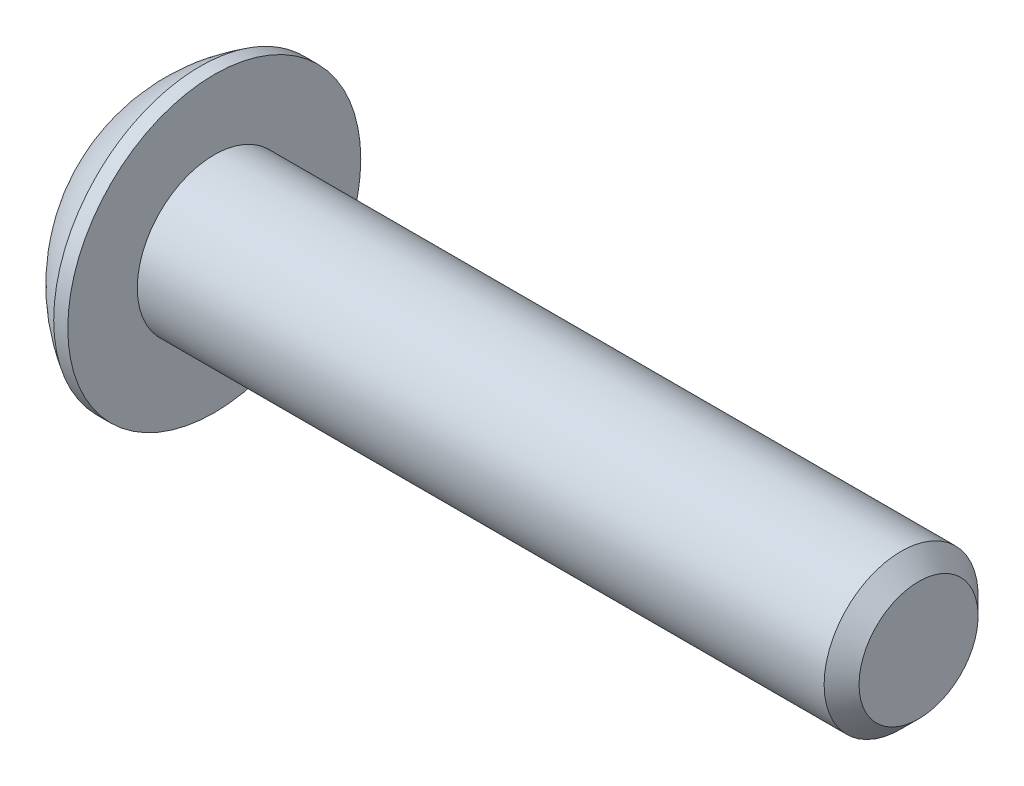
ISO-10303-21;
HEADER;
FILE_DESCRIPTION(('STEP AP214'),'2;1');
FILE_NAME('part.step','',(''),(''),'','','');
FILE_SCHEMA(('AUTOMOTIVE_DESIGN { 1 0 10303 214 1 1 1 1 }'));
ENDSEC;
DATA;
#1=APPLICATION_CONTEXT('core data for automotive mechanical design processes');
#2=APPLICATION_PROTOCOL_DEFINITION('international standard','automotive_design',2000,#1);
#3=PRODUCT_CONTEXT('',#1,'mechanical');
#4=PRODUCT('Part','Part','',(#3));
#5=PRODUCT_RELATED_PRODUCT_CATEGORY('part','',(#4));
#6=PRODUCT_DEFINITION_FORMATION('','',#4);
#7=PRODUCT_DEFINITION_CONTEXT('part definition',#1,'design');
#8=PRODUCT_DEFINITION('design','',#6,#7);
#9=PRODUCT_DEFINITION_SHAPE('','',#8);
#10=(LENGTH_UNIT() NAMED_UNIT(*) SI_UNIT(.MILLI.,.METRE.));
#11=(NAMED_UNIT(*) PLANE_ANGLE_UNIT() SI_UNIT($,.RADIAN.));
#12=(NAMED_UNIT(*) SI_UNIT($,.STERADIAN.) SOLID_ANGLE_UNIT());
#13=UNCERTAINTY_MEASURE_WITH_UNIT(LENGTH_MEASURE(1.E-05),#10,'distance_accuracy_value','');
#14=(GEOMETRIC_REPRESENTATION_CONTEXT(3) GLOBAL_UNCERTAINTY_ASSIGNED_CONTEXT((#13)) GLOBAL_UNIT_ASSIGNED_CONTEXT((#10,
#11,#12)) REPRESENTATION_CONTEXT('',''));
#15=CARTESIAN_POINT('',(0.,0.,0.));
#16=DIRECTION('',(0.,0.,1.));
#17=DIRECTION('',(1.,0.,0.));
#18=AXIS2_PLACEMENT_3D('',#15,#16,#17);
#19=CARTESIAN_POINT('',(1.32080000000034,0.,0.));
#20=DIRECTION('',(-1.,0.,0.));
#21=DIRECTION('',(0.,0.,1.));
#22=AXIS2_PLACEMENT_3D('',#19,#20,#21);
#23=CONICAL_SURFACE('',#22,1.1937999999998,1.04719755119608);
#24=CARTESIAN_POINT('',(2.01004075135902,0.,4.44089209850063E-13));
#25=VERTEX_POINT('',#24);
#26=VERTEX_LOOP('',#25);
#27=FACE_BOUND('',#26,.T.);
#28=CARTESIAN_POINT('',(1.32080000000009,0.,0.));
#29=DIRECTION('',(-1.,0.,0.));
#30=DIRECTION('',(0.,0.,1.));
#31=AXIS2_PLACEMENT_3D('',#28,#29,#30);
#32=CIRCLE('',#31,1.19380000000024);
#33=CARTESIAN_POINT('',(1.32080000000004,-1.03386112703797,0.59690000000006));
#34=VERTEX_POINT('',#33);
#35=CARTESIAN_POINT('',(1.32080000000004,0.,1.19380000000012));
#36=VERTEX_POINT('',#35);
#37=EDGE_CURVE('E18',#34,#36,#32,.T.);
#38=ORIENTED_EDGE('',*,*,#37,.T.);
#39=CARTESIAN_POINT('',(1.32080000000009,0.,0.));
#40=DIRECTION('',(-1.,0.,0.));
#41=DIRECTION('',(0.,0.,1.));
#42=AXIS2_PLACEMENT_3D('',#39,#40,#41);
#43=CIRCLE('',#42,1.19380000000024);
#44=CARTESIAN_POINT('',(1.32080000000004,1.03386112703797,0.596900000000061));
#45=VERTEX_POINT('',#44);
#46=EDGE_CURVE('E139',#36,#45,#43,.T.);
#47=ORIENTED_EDGE('',*,*,#46,.T.);
#48=CARTESIAN_POINT('',(1.32080000000009,0.,0.));
#49=DIRECTION('',(-1.,0.,0.));
#50=DIRECTION('',(0.,0.,1.));
#51=AXIS2_PLACEMENT_3D('',#48,#49,#50);
#52=CIRCLE('',#51,1.19380000000024);
#53=CARTESIAN_POINT('',(1.32080000000004,1.03386112703797,-0.596900000000061));
#54=VERTEX_POINT('',#53);
#55=EDGE_CURVE('E268',#45,#54,#52,.T.);
#56=ORIENTED_EDGE('',*,*,#55,.T.);
#57=CARTESIAN_POINT('',(1.32080000000009,0.,0.));
#58=DIRECTION('',(-1.,0.,0.));
#59=DIRECTION('',(0.,0.,1.));
#60=AXIS2_PLACEMENT_3D('',#57,#58,#59);
#61=CIRCLE('',#60,1.19380000000024);
#62=CARTESIAN_POINT('',(1.32080000000004,1.49457637585666E-12,-1.19380000000012));
#63=VERTEX_POINT('',#62);
#64=EDGE_CURVE('E266',#54,#63,#61,.T.);
#65=ORIENTED_EDGE('',*,*,#64,.T.);
#66=CARTESIAN_POINT('',(1.32080000000009,0.,0.));
#67=DIRECTION('',(-1.,0.,0.));
#68=DIRECTION('',(0.,0.,1.));
#69=AXIS2_PLACEMENT_3D('',#66,#67,#68);
#70=CIRCLE('',#69,1.19380000000024);
#71=CARTESIAN_POINT('',(1.32080000000004,-1.03386112703797,-0.59690000000006));
#72=VERTEX_POINT('',#71);
#73=EDGE_CURVE('E91',#63,#72,#70,.T.);
#74=ORIENTED_EDGE('',*,*,#73,.T.);
#75=CARTESIAN_POINT('',(1.32080000000009,0.,0.));
#76=DIRECTION('',(-1.,0.,0.));
#77=DIRECTION('',(0.,0.,1.));
#78=AXIS2_PLACEMENT_3D('',#75,#76,#77);
#79=CIRCLE('',#78,1.19380000000024);
#80=EDGE_CURVE('E87',#72,#34,#79,.T.);
#81=ORIENTED_EDGE('',*,*,#80,.T.);
#82=EDGE_LOOP('',(#38,#47,#56,#65,#74,#81));
#83=FACE_BOUND('',#82,.T.);
#84=ADVANCED_FACE('F14',(#27,#83),#23,.F.);
#85=CARTESIAN_POINT('',(1.3208,-2.06772225407572,-1.1938));
#86=DIRECTION('',(1.,0.,0.));
#87=DIRECTION('',(0.,0.,-1.));
#88=AXIS2_PLACEMENT_3D('',#85,#86,#87);
#89=PLANE('',#88);
#90=DIRECTION('',(0.,0.5,0.866025403784439));
#91=VECTOR('',#90,1.);
#92=CARTESIAN_POINT('',(1.3208,-1.37848150271715,0.));
#93=LINE('',#92,#91);
#94=CARTESIAN_POINT('',(1.3208,-0.689240751358574,1.1938));
#95=VERTEX_POINT('',#94);
#96=EDGE_CURVE('E99',#95,#34,#93,.F.);
#97=ORIENTED_EDGE('',*,*,#96,.F.);
#98=DIRECTION('',(0.,1.,0.));
#99=VECTOR('',#98,1.);
#100=CARTESIAN_POINT('',(1.3208,-0.689240751358574,1.1938));
#101=LINE('',#100,#99);
#102=EDGE_CURVE('E101',#36,#95,#101,.F.);
#103=ORIENTED_EDGE('',*,*,#102,.F.);
#104=ORIENTED_EDGE('',*,*,#37,.F.);
#105=EDGE_LOOP('',(#97,#103,#104));
#106=FACE_BOUND('',#105,.T.);
#107=ADVANCED_FACE('F97',(#106),#89,.F.);
#108=CARTESIAN_POINT('',(1.3208,-2.06772225407572,-1.1938));
#109=DIRECTION('',(1.,0.,0.));
#110=DIRECTION('',(0.,0.,-1.));
#111=AXIS2_PLACEMENT_3D('',#108,#109,#110);
#112=PLANE('',#111);
#113=DIRECTION('',(0.,-0.5,0.866025403784439));
#114=VECTOR('',#113,1.);
#115=CARTESIAN_POINT('',(1.3208,-0.689240751358574,-1.1938));
#116=LINE('',#115,#114);
#117=CARTESIAN_POINT('',(1.3208,-1.37848150271715,0.));
#118=VERTEX_POINT('',#117);
#119=EDGE_CURVE('E107',#118,#72,#116,.F.);
#120=ORIENTED_EDGE('',*,*,#119,.F.);
#121=DIRECTION('',(0.,0.5,0.866025403784439));
#122=VECTOR('',#121,1.);
#123=CARTESIAN_POINT('',(1.3208,-1.37848150271715,0.));
#124=LINE('',#123,#122);
#125=EDGE_CURVE('E104',#34,#118,#124,.F.);
#126=ORIENTED_EDGE('',*,*,#125,.F.);
#127=ORIENTED_EDGE('',*,*,#80,.F.);
#128=EDGE_LOOP('',(#120,#126,#127));
#129=FACE_BOUND('',#128,.T.);
#130=ADVANCED_FACE('F105',(#129),#112,.F.);
#131=CARTESIAN_POINT('',(1.3208,-2.06772225407572,-1.1938));
#132=DIRECTION('',(1.,0.,0.));
#133=DIRECTION('',(0.,0.,-1.));
#134=AXIS2_PLACEMENT_3D('',#131,#132,#133);
#135=PLANE('',#134);
#136=DIRECTION('',(0.,1.,0.));
#137=VECTOR('',#136,1.);
#138=CARTESIAN_POINT('',(1.3208,0.689240751358577,-1.1938));
#139=LINE('',#138,#137);
#140=CARTESIAN_POINT('',(1.3208,-0.689240751358574,-1.1938));
#141=VERTEX_POINT('',#140);
#142=EDGE_CURVE('E235',#141,#63,#139,.T.);
#143=ORIENTED_EDGE('',*,*,#142,.F.);
#144=DIRECTION('',(0.,-0.5,0.866025403784439));
#145=VECTOR('',#144,1.);
#146=CARTESIAN_POINT('',(1.3208,-0.689240751358574,-1.1938));
#147=LINE('',#146,#145);
#148=EDGE_CURVE('E240',#72,#141,#147,.F.);
#149=ORIENTED_EDGE('',*,*,#148,.F.);
#150=ORIENTED_EDGE('',*,*,#73,.F.);
#151=EDGE_LOOP('',(#143,#149,#150));
#152=FACE_BOUND('',#151,.T.);
#153=ADVANCED_FACE('F182',(#152),#135,.F.);
#154=CARTESIAN_POINT('',(1.3208,-2.06772225407572,-1.1938));
#155=DIRECTION('',(1.,0.,0.));
#156=DIRECTION('',(0.,0.,-1.));
#157=AXIS2_PLACEMENT_3D('',#154,#155,#156);
#158=PLANE('',#157);
#159=DIRECTION('',(0.,-0.5,-0.866025403784439));
#160=VECTOR('',#159,1.);
#161=CARTESIAN_POINT('',(1.3208,1.37848150271715,0.));
#162=LINE('',#161,#160);
#163=CARTESIAN_POINT('',(1.3208,0.689240751358577,-1.1938));
#164=VERTEX_POINT('',#163);
#165=EDGE_CURVE('E226',#164,#54,#162,.F.);
#166=ORIENTED_EDGE('',*,*,#165,.F.);
#167=DIRECTION('',(0.,1.,0.));
#168=VECTOR('',#167,1.);
#169=CARTESIAN_POINT('',(1.3208,0.689240751358577,-1.1938));
#170=LINE('',#169,#168);
#171=EDGE_CURVE('E232',#63,#164,#170,.T.);
#172=ORIENTED_EDGE('',*,*,#171,.F.);
#173=ORIENTED_EDGE('',*,*,#64,.F.);
#174=EDGE_LOOP('',(#166,#172,#173));
#175=FACE_BOUND('',#174,.T.);
#176=ADVANCED_FACE('F178',(#175),#158,.F.);
#177=CARTESIAN_POINT('',(1.3208,-2.06772225407572,-1.1938));
#178=DIRECTION('',(1.,0.,0.));
#179=DIRECTION('',(0.,0.,-1.));
#180=AXIS2_PLACEMENT_3D('',#177,#178,#179);
#181=PLANE('',#180);
#182=DIRECTION('',(0.,0.5,-0.866025403784439));
#183=VECTOR('',#182,1.);
#184=CARTESIAN_POINT('',(1.3208,0.689240751358576,1.1938));
#185=LINE('',#184,#183);
#186=CARTESIAN_POINT('',(1.3208,1.37848150271715,0.));
#187=VERTEX_POINT('',#186);
#188=EDGE_CURVE('E213',#187,#45,#185,.F.);
#189=ORIENTED_EDGE('',*,*,#188,.F.);
#190=DIRECTION('',(0.,-0.5,-0.866025403784439));
#191=VECTOR('',#190,1.);
#192=CARTESIAN_POINT('',(1.3208,1.37848150271715,0.));
#193=LINE('',#192,#191);
#194=EDGE_CURVE('E224',#54,#187,#193,.F.);
#195=ORIENTED_EDGE('',*,*,#194,.F.);
#196=ORIENTED_EDGE('',*,*,#55,.F.);
#197=EDGE_LOOP('',(#189,#195,#196));
#198=FACE_BOUND('',#197,.T.);
#199=ADVANCED_FACE('F174',(#198),#181,.F.);
#200=CARTESIAN_POINT('',(1.3208,-2.06772225407572,-1.1938));
#201=DIRECTION('',(1.,0.,0.));
#202=DIRECTION('',(0.,0.,-1.));
#203=AXIS2_PLACEMENT_3D('',#200,#201,#202);
#204=PLANE('',#203);
#205=DIRECTION('',(0.,1.,0.));
#206=VECTOR('',#205,1.);
#207=CARTESIAN_POINT('',(1.3208,-0.689240751358574,1.1938));
#208=LINE('',#207,#206);
#209=CARTESIAN_POINT('',(1.3208,0.689240751358576,1.1938));
#210=VERTEX_POINT('',#209);
#211=EDGE_CURVE('E116',#210,#36,#208,.F.);
#212=ORIENTED_EDGE('',*,*,#211,.F.);
#213=DIRECTION('',(0.,0.5,-0.866025403784439));
#214=VECTOR('',#213,1.);
#215=CARTESIAN_POINT('',(1.3208,0.689240751358576,1.1938));
#216=LINE('',#215,#214);
#217=EDGE_CURVE('E216',#45,#210,#216,.F.);
#218=ORIENTED_EDGE('',*,*,#217,.F.);
#219=ORIENTED_EDGE('',*,*,#46,.F.);
#220=EDGE_LOOP('',(#212,#218,#219));
#221=FACE_BOUND('',#220,.T.);
#222=ADVANCED_FACE('F170',(#221),#204,.F.);
#223=CARTESIAN_POINT('',(1.3208,-0.689240751358574,1.1938));
#224=DIRECTION('',(0.,0.,-1.));
#225=DIRECTION('',(0.,1.,0.));
#226=AXIS2_PLACEMENT_3D('',#223,#224,#225);
#227=PLANE('',#226);
#228=DIRECTION('',(0.,1.,0.));
#229=VECTOR('',#228,1.);
#230=CARTESIAN_POINT('',(0.,0.,1.1938));
#231=LINE('',#230,#229);
#232=CARTESIAN_POINT('',(0.,0.689240751358577,1.1938));
#233=VERTEX_POINT('',#232);
#234=CARTESIAN_POINT('',(0.,-0.689240751358574,1.1938));
#235=VERTEX_POINT('',#234);
#236=EDGE_CURVE('E228',#233,#235,#231,.F.);
#237=ORIENTED_EDGE('',*,*,#236,.F.);
#238=DIRECTION('',(1.,0.,0.));
#239=VECTOR('',#238,1.);
#240=CARTESIAN_POINT('',(1.3208,0.689240751358576,1.1938));
#241=LINE('',#240,#239);
#242=EDGE_CURVE('E220',#210,#233,#241,.F.);
#243=ORIENTED_EDGE('',*,*,#242,.F.);
#244=ORIENTED_EDGE('',*,*,#211,.T.);
#245=ORIENTED_EDGE('',*,*,#102,.T.);
#246=DIRECTION('',(1.,0.,0.));
#247=VECTOR('',#246,1.);
#248=CARTESIAN_POINT('',(1.3208,-0.689240751358574,1.1938));
#249=LINE('',#248,#247);
#250=EDGE_CURVE('E110',#235,#95,#249,.T.);
#251=ORIENTED_EDGE('',*,*,#250,.F.);
#252=EDGE_LOOP('',(#237,#243,#244,#245,#251));
#253=FACE_BOUND('',#252,.T.);
#254=ADVANCED_FACE('F167',(#253),#227,.T.);
#255=CARTESIAN_POINT('',(1.3208,-1.37848150271715,0.));
#256=DIRECTION('',(0.,0.866025403784439,-0.5));
#257=DIRECTION('',(0.,0.5,0.866025403784439));
#258=AXIS2_PLACEMENT_3D('',#255,#256,#257);
#259=PLANE('',#258);
#260=DIRECTION('',(0.,-0.5,-0.866025403784439));
#261=VECTOR('',#260,1.);
#262=CARTESIAN_POINT('',(0.,-0.689240751358574,1.1938));
#263=LINE('',#262,#261);
#264=CARTESIAN_POINT('',(0.,-1.37848150271715,0.));
#265=VERTEX_POINT('',#264);
#266=EDGE_CURVE('E249',#235,#265,#263,.T.);
#267=ORIENTED_EDGE('',*,*,#266,.F.);
#268=ORIENTED_EDGE('',*,*,#250,.T.);
#269=ORIENTED_EDGE('',*,*,#96,.T.);
#270=ORIENTED_EDGE('',*,*,#125,.T.);
#271=DIRECTION('',(1.,0.,0.));
#272=VECTOR('',#271,1.);
#273=CARTESIAN_POINT('',(1.3208,-1.37848150271715,0.));
#274=LINE('',#273,#272);
#275=EDGE_CURVE('E119',#265,#118,#274,.T.);
#276=ORIENTED_EDGE('',*,*,#275,.F.);
#277=EDGE_LOOP('',(#267,#268,#269,#270,#276));
#278=FACE_BOUND('',#277,.T.);
#279=ADVANCED_FACE('F114',(#278),#259,.T.);
#280=CARTESIAN_POINT('',(1.3208,-0.689240751358574,-1.1938));
#281=DIRECTION('',(0.,0.866025403784439,0.5));
#282=DIRECTION('',(0.,-0.5,0.866025403784439));
#283=AXIS2_PLACEMENT_3D('',#280,#281,#282);
#284=PLANE('',#283);
#285=DIRECTION('',(0.,0.5,-0.866025403784439));
#286=VECTOR('',#285,1.);
#287=CARTESIAN_POINT('',(0.,-1.37848150271715,0.));
#288=LINE('',#287,#286);
#289=CARTESIAN_POINT('',(0.,-0.689240751358574,-1.1938));
#290=VERTEX_POINT('',#289);
#291=EDGE_CURVE('E247',#265,#290,#288,.T.);
#292=ORIENTED_EDGE('',*,*,#291,.F.);
#293=ORIENTED_EDGE('',*,*,#275,.T.);
#294=ORIENTED_EDGE('',*,*,#119,.T.);
#295=ORIENTED_EDGE('',*,*,#148,.T.);
#296=DIRECTION('',(1.,0.,0.));
#297=VECTOR('',#296,1.);
#298=CARTESIAN_POINT('',(1.3208,-0.689240751358574,-1.1938));
#299=LINE('',#298,#297);
#300=EDGE_CURVE('E231',#290,#141,#299,.T.);
#301=ORIENTED_EDGE('',*,*,#300,.F.);
#302=EDGE_LOOP('',(#292,#293,#294,#295,#301));
#303=FACE_BOUND('',#302,.T.);
#304=ADVANCED_FACE('F160',(#303),#284,.T.);
#305=CARTESIAN_POINT('',(1.3208,0.689240751358577,-1.1938));
#306=DIRECTION('',(0.,0.,1.));
#307=DIRECTION('',(1.,0.,0.));
#308=AXIS2_PLACEMENT_3D('',#305,#306,#307);
#309=PLANE('',#308);
#310=DIRECTION('',(0.,1.,0.));
#311=VECTOR('',#310,1.);
#312=CARTESIAN_POINT('',(0.,0.,-1.1938));
#313=LINE('',#312,#311);
#314=CARTESIAN_POINT('',(0.,0.689240751358577,-1.1938));
#315=VERTEX_POINT('',#314);
#316=EDGE_CURVE('E258',#290,#315,#313,.T.);
#317=ORIENTED_EDGE('',*,*,#316,.F.);
#318=ORIENTED_EDGE('',*,*,#300,.T.);
#319=ORIENTED_EDGE('',*,*,#142,.T.);
#320=ORIENTED_EDGE('',*,*,#171,.T.);
#321=DIRECTION('',(1.,0.,0.));
#322=VECTOR('',#321,1.);
#323=CARTESIAN_POINT('',(1.3208,0.689240751358577,-1.1938));
#324=LINE('',#323,#322);
#325=EDGE_CURVE('E217',#315,#164,#324,.T.);
#326=ORIENTED_EDGE('',*,*,#325,.F.);
#327=EDGE_LOOP('',(#317,#318,#319,#320,#326));
#328=FACE_BOUND('',#327,.T.);
#329=ADVANCED_FACE('F157',(#328),#309,.T.);
#330=CARTESIAN_POINT('',(1.3208,1.37848150271715,0.));
#331=DIRECTION('',(0.,-0.866025403784439,0.5));
#332=DIRECTION('',(0.,-0.5,-0.866025403784439));
#333=AXIS2_PLACEMENT_3D('',#330,#331,#332);
#334=PLANE('',#333);
#335=DIRECTION('',(0.,0.5,0.866025403784439));
#336=VECTOR('',#335,1.);
#337=CARTESIAN_POINT('',(0.,0.689240751358577,-1.1938));
#338=LINE('',#337,#336);
#339=CARTESIAN_POINT('',(0.,1.37848150271715,0.));
#340=VERTEX_POINT('',#339);
#341=EDGE_CURVE('E261',#315,#340,#338,.T.);
#342=ORIENTED_EDGE('',*,*,#341,.F.);
#343=ORIENTED_EDGE('',*,*,#325,.T.);
#344=ORIENTED_EDGE('',*,*,#165,.T.);
#345=ORIENTED_EDGE('',*,*,#194,.T.);
#346=DIRECTION('',(1.,0.,0.));
#347=VECTOR('',#346,1.);
#348=CARTESIAN_POINT('',(1.3208,1.37848150271715,0.));
#349=LINE('',#348,#347);
#350=EDGE_CURVE('E33',#340,#187,#349,.T.);
#351=ORIENTED_EDGE('',*,*,#350,.F.);
#352=EDGE_LOOP('',(#342,#343,#344,#345,#351));
#353=FACE_BOUND('',#352,.T.);
#354=ADVANCED_FACE('F153',(#353),#334,.T.);
#355=CARTESIAN_POINT('',(1.3208,0.689240751358576,1.1938));
#356=DIRECTION('',(0.,-0.866025403784439,-0.5));
#357=DIRECTION('',(0.,0.5,-0.866025403784439));
#358=AXIS2_PLACEMENT_3D('',#355,#356,#357);
#359=PLANE('',#358);
#360=DIRECTION('',(0.,-0.5,0.866025403784439));
#361=VECTOR('',#360,1.);
#362=CARTESIAN_POINT('',(0.,1.37848150271715,0.));
#363=LINE('',#362,#361);
#364=EDGE_CURVE('E138',#340,#233,#363,.T.);
#365=ORIENTED_EDGE('',*,*,#364,.F.);
#366=ORIENTED_EDGE('',*,*,#350,.T.);
#367=ORIENTED_EDGE('',*,*,#188,.T.);
#368=ORIENTED_EDGE('',*,*,#217,.T.);
#369=ORIENTED_EDGE('',*,*,#242,.T.);
#370=EDGE_LOOP('',(#365,#366,#367,#368,#369));
#371=FACE_BOUND('',#370,.T.);
#372=ADVANCED_FACE('F149',(#371),#359,.T.);
#373=CARTESIAN_POINT('',(0.,0.,0.));
#374=DIRECTION('',(-1.,0.,0.));
#375=DIRECTION('',(0.,0.,1.));
#376=AXIS2_PLACEMENT_3D('',#373,#374,#375);
#377=PLANE('',#376);
#378=ORIENTED_EDGE('',*,*,#341,.T.);
#379=ORIENTED_EDGE('',*,*,#364,.T.);
#380=ORIENTED_EDGE('',*,*,#236,.T.);
#381=ORIENTED_EDGE('',*,*,#266,.T.);
#382=ORIENTED_EDGE('',*,*,#291,.T.);
#383=ORIENTED_EDGE('',*,*,#316,.T.);
#384=EDGE_LOOP('',(#378,#379,#380,#381,#382,#383));
#385=FACE_BOUND('',#384,.T.);
#386=CARTESIAN_POINT('',(0.,1.9812,0.));
#387=CARTESIAN_POINT('',(0.,1.9811996664299,0.0556258831179429));
#388=CARTESIAN_POINT('',(0.,1.97885520380442,0.111261989398606));
#389=CARTESIAN_POINT('',(0.,1.96949260169541,0.222149719830458));
#390=CARTESIAN_POINT('',(0.,1.96247308239606,0.277401225602896));
#391=CARTESIAN_POINT('',(0.,1.94379192841039,0.387209508139748));
#392=CARTESIAN_POINT('',(-1.85322098412163E-13,1.93212292489526,0.441765039546366));
#393=CARTESIAN_POINT('',(1.86340516395781E-13,1.90422331175315,0.549729449347493));
#394=CARTESIAN_POINT('',(6.9454338814387E-13,1.88798900035338,0.603137359208869));
#395=CARTESIAN_POINT('',(1.15501971975443E-12,1.832662144765,0.760839131321828));
#396=CARTESIAN_POINT('',(0.,1.78690023648845,0.86287643357543));
#397=CARTESIAN_POINT('',(0.,1.67887358150667,1.05780719540872));
#398=CARTESIAN_POINT('',(9.54252846156157E-13,1.6166082074585,1.15070030720801));
#399=CARTESIAN_POINT('',(5.94775737193293E-13,1.51224157140982,1.28116890915698));
#400=CARTESIAN_POINT('',(1.63135429314554E-13,1.47559703943539,1.32320451127027));
#401=CARTESIAN_POINT('',(-1.62111198585679E-13,1.39893832619713,1.40400288695709));
#402=CARTESIAN_POINT('',(0.,1.35892742784698,1.44276877695455));
#403=CARTESIAN_POINT('',(1.13736409396491E-13,1.23416504602197,1.55382272417904));
#404=CARTESIAN_POINT('',(0.,1.14466125559859,1.62089527952111));
#405=CARTESIAN_POINT('',(0.,0.955712144178161,1.73902218081179));
#406=CARTESIAN_POINT('',(0.,0.856267198233561,1.79007713076008));
#407=CARTESIAN_POINT('',(0.,0.65020634591084,1.87477637530954));
#408=CARTESIAN_POINT('',(0.,0.543590516134851,1.90842085586266));
#409=CARTESIAN_POINT('',(0.,0.326226155292014,1.95733039300656));
#410=CARTESIAN_POINT('',(0.,0.215477602157926,1.97259535144288));
#411=CARTESIAN_POINT('',(0.,-0.00701040587545002,1.98431697865418));
#412=CARTESIAN_POINT('',(0.,-0.118749860774737,1.98077364742916));
#413=CARTESIAN_POINT('',(0.,-0.340050178355489,1.95497485623824));
#414=CARTESIAN_POINT('',(0.,-0.449611052668259,1.93271949620217));
#415=CARTESIAN_POINT('',(0.,-0.663431110729177,1.87014138774524));
#416=CARTESIAN_POINT('',(0.,-0.767690237838523,1.82981844635272));
#417=CARTESIAN_POINT('',(0.,-0.968005760719348,1.73219968377096));
#418=CARTESIAN_POINT('',(0.,-1.0640618469811,1.6749032225164));
#419=CARTESIAN_POINT('',(0.,-1.19980276751283,1.57757371205873));
#420=CARTESIAN_POINT('',(0.,-1.24366557129214,1.54322665019466));
#421=CARTESIAN_POINT('',(0.,-1.32838995706696,1.47093063174264));
#422=CARTESIAN_POINT('',(0.,-1.36924860178706,1.43297823102439));
#423=CARTESIAN_POINT('',(0.,-1.48674671849223,1.31419842051172));
#424=CARTESIAN_POINT('',(0.,-1.55842832343237,1.22836221289311));
#425=CARTESIAN_POINT('',(0.,-1.6863396856475,1.04586168272493));
#426=CARTESIAN_POINT('',(0.,-1.7425700302488,0.949197771949769));
#427=CARTESIAN_POINT('',(0.,-1.8141614250401,0.798182600298679));
#428=CARTESIAN_POINT('',(0.,-1.83591780585875,0.746776203847787));
#429=CARTESIAN_POINT('',(0.,-1.87500754181092,0.642341081688632));
#430=CARTESIAN_POINT('',(0.,-1.89234447645404,0.589313708122843));
#431=CARTESIAN_POINT('',(0.,-1.92246053433555,0.482076273028391));
#432=CARTESIAN_POINT('',(0.,-1.93524685475118,0.427868224257506));
#433=CARTESIAN_POINT('',(0.,-1.95620937250494,0.318578151844607));
#434=CARTESIAN_POINT('',(0.,-1.96438692958147,0.263496390912868));
#435=CARTESIAN_POINT('',(0.,-1.97388528284653,0.173607715038555));
#436=CARTESIAN_POINT('',(0.,-1.97662743364426,0.138944718024995));
#437=CARTESIAN_POINT('',(0.,-1.98028489645283,0.069522478256699));
#438=CARTESIAN_POINT('',(0.,-1.98120020846367,0.0347632355019625));
#439=CARTESIAN_POINT('',(0.,-1.9811996664299,-0.0556258831179437));
#440=CARTESIAN_POINT('',(0.,-1.97885520380442,-0.111261989398607));
#441=CARTESIAN_POINT('',(0.,-1.96949260169541,-0.222149719830459));
#442=CARTESIAN_POINT('',(0.,-1.96247308239605,-0.277401225602897));
#443=CARTESIAN_POINT('',(0.,-1.94379192841039,-0.387209508139749));
#444=CARTESIAN_POINT('',(-1.85273829369933E-13,-1.93212292489526,-0.441765039546367));
#445=CARTESIAN_POINT('',(1.86292208101257E-13,-1.90422331175315,-0.549729449347495));
#446=CARTESIAN_POINT('',(6.94526512411752E-13,-1.88798900035338,-0.603137359208872));
#447=CARTESIAN_POINT('',(1.15505339077404E-12,-1.83266214476501,-0.760839131321831));
#448=CARTESIAN_POINT('',(0.,-1.78690023648846,-0.862876433575432));
#449=CARTESIAN_POINT('',(0.,-1.67887358150667,-1.05780719540872));
#450=CARTESIAN_POINT('',(9.54248949793369E-13,-1.6166082074585,-1.15070030720801));
#451=CARTESIAN_POINT('',(5.94777687927534E-13,-1.51224157140982,-1.28116890915698));
#452=CARTESIAN_POINT('',(1.63138929838936E-13,-1.4755970394354,-1.32320451127027));
#453=CARTESIAN_POINT('',(-1.62114695735028E-13,-1.39893832619713,-1.40400288695709));
#454=CARTESIAN_POINT('',(0.,-1.35892742784699,-1.44276877695455));
#455=CARTESIAN_POINT('',(1.13760471433616E-13,-1.23416504602197,-1.55382272417904));
#456=CARTESIAN_POINT('',(0.,-1.14466125559859,-1.62089527952111));
#457=CARTESIAN_POINT('',(0.,-0.95571214417816,-1.73902218081179));
#458=CARTESIAN_POINT('',(0.,-0.856267198233559,-1.79007713076007));
#459=CARTESIAN_POINT('',(0.,-0.650206345910841,-1.87477637530954));
#460=CARTESIAN_POINT('',(0.,-0.543590516134854,-1.90842085586267));
#461=CARTESIAN_POINT('',(0.,-0.326226155292018,-1.95733039300657));
#462=CARTESIAN_POINT('',(0.,-0.215477602157928,-1.97259535144288));
#463=CARTESIAN_POINT('',(0.,0.00701040587544881,-1.98431697865418));
#464=CARTESIAN_POINT('',(0.,0.118749860774737,-1.98077364742916));
#465=CARTESIAN_POINT('',(0.,0.340050178355489,-1.95497485623824));
#466=CARTESIAN_POINT('',(0.,0.44961105266826,-1.93271949620218));
#467=CARTESIAN_POINT('',(0.,0.663431110729178,-1.87014138774524));
#468=CARTESIAN_POINT('',(0.,0.767690237838524,-1.82981844635272));
#469=CARTESIAN_POINT('',(0.,0.968005760719347,-1.73219968377096));
#470=CARTESIAN_POINT('',(0.,1.0640618469811,-1.67490322251639));
#471=CARTESIAN_POINT('',(0.,1.19980276751283,-1.57757371205873));
#472=CARTESIAN_POINT('',(0.,1.24366557129214,-1.54322665019465));
#473=CARTESIAN_POINT('',(0.,1.32838995706696,-1.47093063174263));
#474=CARTESIAN_POINT('',(0.,1.36924860178706,-1.43297823102439));
#475=CARTESIAN_POINT('',(0.,1.48674671849223,-1.31419842051172));
#476=CARTESIAN_POINT('',(0.,1.55842832343237,-1.22836221289311));
#477=CARTESIAN_POINT('',(0.,1.6863396856475,-1.04586168272493));
#478=CARTESIAN_POINT('',(0.,1.7425700302488,-0.94919777194977));
#479=CARTESIAN_POINT('',(0.,1.8141614250401,-0.798182600298679));
#480=CARTESIAN_POINT('',(0.,1.83591780585875,-0.746776203847786));
#481=CARTESIAN_POINT('',(0.,1.87500754181092,-0.642341081688631));
#482=CARTESIAN_POINT('',(0.,1.89234447645404,-0.589313708122842));
#483=CARTESIAN_POINT('',(0.,1.92246053433555,-0.482076273028391));
#484=CARTESIAN_POINT('',(0.,1.93524685475118,-0.427868224257506));
#485=CARTESIAN_POINT('',(0.,1.95620937250494,-0.318578151844607));
#486=CARTESIAN_POINT('',(0.,1.96438692958147,-0.263496390912867));
#487=CARTESIAN_POINT('',(0.,1.97388528284653,-0.173607715038554));
#488=CARTESIAN_POINT('',(0.,1.97662743364426,-0.138944718024995));
#489=CARTESIAN_POINT('',(0.,1.98028489645283,-0.0695224782566994));
#490=CARTESIAN_POINT('',(0.,1.98120020846367,-0.0347632355019633));
#491=CARTESIAN_POINT('',(0.,1.9812,0.));
#492=B_SPLINE_CURVE_WITH_KNOTS('',3,(#386,#387,#388,#389,#390,#391,#392,#393,#394,#395,#396,
#397,#398,#399,#400,#401,#402,#403,#404,#405,#406,#407,#408,#409,#410,#411,#412,#413,#414,#415,
#416,#417,#418,#419,#420,#421,#422,#423,#424,#425,#426,#427,#428,#429,#430,#431,#432,#433,#434,
#435,#436,#437,#438,#439,#440,#441,#442,#443,#444,#445,#446,#447,#448,#449,#450,#451,#452,#453,
#454,#455,#456,#457,#458,#459,#460,#461,#462,#463,#464,#465,#466,#467,#468,#469,#470,#471,#472,
#473,#474,#475,#476,#477,#478,#479,#480,#481,#482,#483,#484,#485,#486,#487,#488,#489,#490,#491),
.UNSPECIFIED.,.T.,.F.,(4,2,2,2,2,2,2,2,2,2,2,2,2,2,2,2,2,2,2,2,2,2,2,2,2,2,2,2,2,2,2,2,2,2,2,2,
2,2,2,2,2,2,2,2,2,2,2,2,2,2,2,2,4),(0.,0.166845646007828,0.333740557374256,0.500901034367694,
0.668197445942387,1.00199278686282,1.33580081809885,1.50292354032982,1.6698851310853,
2.00370118900129,2.33750465770544,2.67130456115909,3.00510624723801,3.33890793331696,
3.67270783677065,4.00651130547476,4.34032736339026,4.50728895414554,4.67441167637632,
5.0082197076126,5.34201504853333,5.50931146010827,5.67647193710192,5.84336684846844,
6.01021249447641,6.11448220058334,6.21875190669029,6.38559755269811,6.55249246406454,
6.71965294105798,6.88694935263267,7.22074469355311,7.55455272478914,7.72167544702011,
7.88863703777559,8.22245309569158,8.55625656439573,8.89005646784938,9.2238581539283,
9.55765984000725,9.89145974346094,10.225263212165,10.5590792700806,10.7260408608358,
10.8931635830666,11.2269716143029,11.5607669552236,11.7280633667986,11.8952238437922,
12.0621187551587,12.2289644011667,12.3332341072736,12.4375038133806),.UNSPECIFIED.);
#493=CARTESIAN_POINT('',(0.,1.9812,0.));
#494=VERTEX_POINT('',#493);
#495=EDGE_CURVE('E131',#494,#494,#492,.T.);
#496=ORIENTED_EDGE('',*,*,#495,.F.);
#497=EDGE_LOOP('',(#496));
#498=FACE_BOUND('',#497,.T.);
#499=ADVANCED_FACE('F145',(#385,#498),#377,.T.);
#500=CARTESIAN_POINT('',(4.13385,0.,0.));
#501=DIRECTION('',(0.,1.,0.));
#502=DIRECTION('',(1.,0.,0.));
#503=AXIS2_PLACEMENT_3D('',#500,#501,#502);
#504=SPHERICAL_SURFACE('',#503,4.58408870578439);
#505=CARTESIAN_POINT('',(1.8288,0.,0.));
#506=DIRECTION('',(-1.,0.,0.));
#507=DIRECTION('',(0.,0.,1.));
#508=AXIS2_PLACEMENT_3D('',#505,#506,#507);
#509=CIRCLE('',#508,3.9624);
#510=CARTESIAN_POINT('',(1.8288,0.,3.9624));
#511=VERTEX_POINT('',#510);
#512=EDGE_CURVE('E128',#511,#511,#509,.F.);
#513=ORIENTED_EDGE('',*,*,#512,.F.);
#514=EDGE_LOOP('',(#513));
#515=FACE_BOUND('',#514,.T.);
#516=ORIENTED_EDGE('',*,*,#495,.T.);
#517=EDGE_LOOP('',(#516));
#518=FACE_BOUND('',#517,.T.);
#519=ADVANCED_FACE('F141',(#515,#518),#504,.T.);
#520=CARTESIAN_POINT('',(21.2598,0.,0.));
#521=DIRECTION('',(-1.,0.,0.));
#522=DIRECTION('',(0.,0.,1.));
#523=AXIS2_PLACEMENT_3D('',#520,#521,#522);
#524=PLANE('',#523);
#525=CARTESIAN_POINT('',(21.2597999999389,0.,0.));
#526=DIRECTION('',(-1.,0.,0.));
#527=DIRECTION('',(0.,0.,1.));
#528=AXIS2_PLACEMENT_3D('',#525,#526,#527);
#529=CIRCLE('',#528,1.61036000002923);
#530=CARTESIAN_POINT('',(21.2597999999389,0.,1.61036000002923));
#531=VERTEX_POINT('',#530);
#532=EDGE_CURVE('E125',#531,#531,#529,.T.);
#533=ORIENTED_EDGE('',*,*,#532,.F.);
#534=EDGE_LOOP('',(#533));
#535=FACE_BOUND('',#534,.T.);
#536=ADVANCED_FACE('F276',(#535),#524,.F.);
#537=CARTESIAN_POINT('',(0.,0.,0.));
#538=DIRECTION('',(-1.,0.,0.));
#539=DIRECTION('',(0.,0.,1.));
#540=AXIS2_PLACEMENT_3D('',#537,#538,#539);
#541=CYLINDRICAL_SURFACE('',#540,3.9624);
#542=ORIENTED_EDGE('',*,*,#512,.T.);
#543=EDGE_LOOP('',(#542));
#544=FACE_BOUND('',#543,.T.);
#545=CARTESIAN_POINT('',(2.2098,0.,0.));
#546=DIRECTION('',(-1.,0.,0.));
#547=DIRECTION('',(0.,0.,1.));
#548=AXIS2_PLACEMENT_3D('',#545,#546,#547);
#549=CIRCLE('',#548,3.9624);
#550=CARTESIAN_POINT('',(2.2098,0.,3.9624));
#551=VERTEX_POINT('',#550);
#552=EDGE_CURVE('E122',#551,#551,#549,.T.);
#553=ORIENTED_EDGE('',*,*,#552,.T.);
#554=EDGE_LOOP('',(#553));
#555=FACE_BOUND('',#554,.T.);
#556=ADVANCED_FACE('F281',(#544,#555),#541,.T.);
#557=CARTESIAN_POINT('',(20.7873600000426,0.,0.));
#558=DIRECTION('',(-1.,0.,0.));
#559=DIRECTION('',(0.,0.,1.));
#560=AXIS2_PLACEMENT_3D('',#557,#558,#559);
#561=CONICAL_SURFACE('',#560,2.08279999992556,0.785398163397448);
#562=CARTESIAN_POINT('',(20.78736,0.,0.));
#563=DIRECTION('',(-1.,0.,0.));
#564=DIRECTION('',(0.,0.,1.));
#565=AXIS2_PLACEMENT_3D('',#562,#563,#564);
#566=CIRCLE('',#565,2.0828);
#567=CARTESIAN_POINT('',(20.78736,0.,2.0828));
#568=VERTEX_POINT('',#567);
#569=EDGE_CURVE('E24',#568,#568,#566,.T.);
#570=ORIENTED_EDGE('',*,*,#569,.F.);
#571=EDGE_LOOP('',(#570));
#572=FACE_BOUND('',#571,.T.);
#573=ORIENTED_EDGE('',*,*,#532,.T.);
#574=EDGE_LOOP('',(#573));
#575=FACE_BOUND('',#574,.T.);
#576=ADVANCED_FACE('F202',(#572,#575),#561,.T.);
#577=CARTESIAN_POINT('',(2.2098,2.0828,0.));
#578=DIRECTION('',(-1.,0.,0.));
#579=DIRECTION('',(0.,0.,1.));
#580=AXIS2_PLACEMENT_3D('',#577,#578,#579);
#581=PLANE('',#580);
#582=CARTESIAN_POINT('',(2.2098,0.,0.));
#583=DIRECTION('',(-1.,0.,0.));
#584=DIRECTION('',(0.,0.,1.));
#585=AXIS2_PLACEMENT_3D('',#582,#583,#584);
#586=CIRCLE('',#585,2.0828);
#587=CARTESIAN_POINT('',(2.2098,0.,2.0828));
#588=VERTEX_POINT('',#587);
#589=EDGE_CURVE('E9',#588,#588,#586,.F.);
#590=ORIENTED_EDGE('',*,*,#589,.F.);
#591=EDGE_LOOP('',(#590));
#592=FACE_BOUND('',#591,.T.);
#593=ORIENTED_EDGE('',*,*,#552,.F.);
#594=EDGE_LOOP('',(#593));
#595=FACE_BOUND('',#594,.T.);
#596=ADVANCED_FACE('F197',(#592,#595),#581,.F.);
#597=CARTESIAN_POINT('',(0.,0.,0.));
#598=DIRECTION('',(-1.,0.,0.));
#599=DIRECTION('',(0.,0.,1.));
#600=AXIS2_PLACEMENT_3D('',#597,#598,#599);
#601=CYLINDRICAL_SURFACE('',#600,2.0828);
#602=ORIENTED_EDGE('',*,*,#589,.T.);
#603=EDGE_LOOP('',(#602));
#604=FACE_BOUND('',#603,.T.);
#605=ORIENTED_EDGE('',*,*,#569,.T.);
#606=EDGE_LOOP('',(#605));
#607=FACE_BOUND('',#606,.T.);
#608=ADVANCED_FACE('F16',(#604,#607),#601,.T.);
#609=CLOSED_SHELL('',(#84,#107,#130,#153,#176,#199,#222,#254,#279,#304,#329,#354,#372,#499,#519,
#536,#556,#576,#596,#608));
#610=MANIFOLD_SOLID_BREP('B1',#609);
#611=ADVANCED_BREP_SHAPE_REPRESENTATION('',(#18,#610),#14);
#612=SHAPE_DEFINITION_REPRESENTATION(#9,#611);
ENDSEC;
END-ISO-10303-21;
